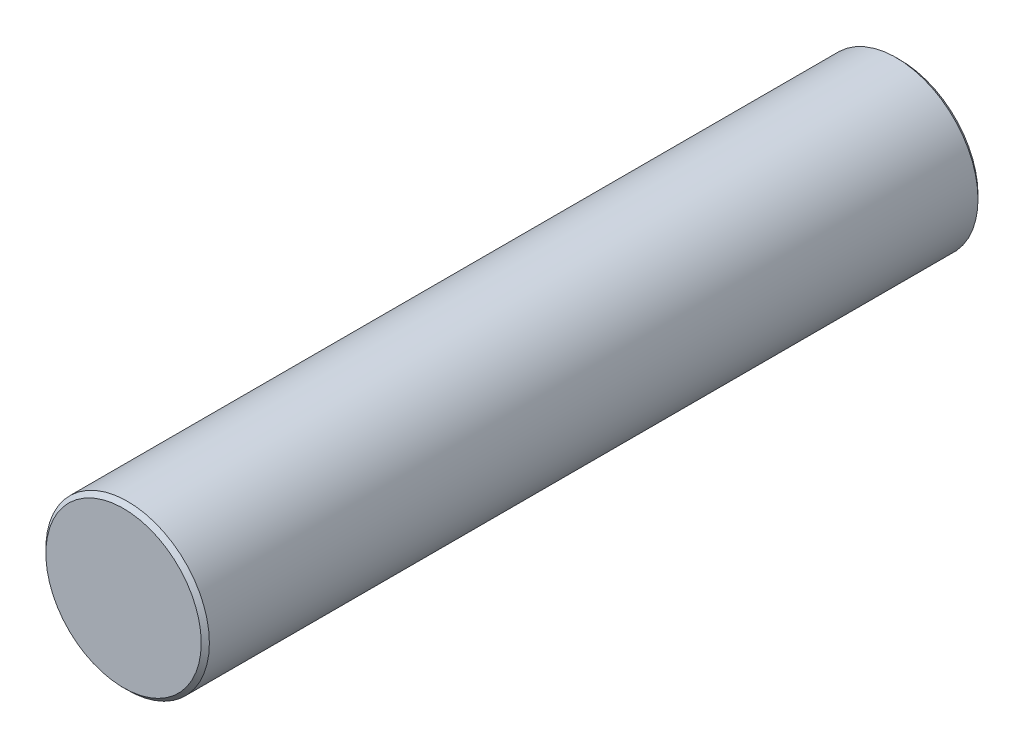
ISO-10303-21;
HEADER;
FILE_DESCRIPTION(('STEP AP214'),'2;1');
FILE_NAME('part.step','',(''),(''),'','','');
FILE_SCHEMA(('AUTOMOTIVE_DESIGN { 1 0 10303 214 1 1 1 1 }'));
ENDSEC;
DATA;
#1=APPLICATION_CONTEXT('core data for automotive mechanical design processes');
#2=APPLICATION_PROTOCOL_DEFINITION('international standard','automotive_design',2000,#1);
#3=PRODUCT_CONTEXT('',#1,'mechanical');
#4=PRODUCT('Part','Part','',(#3));
#5=PRODUCT_RELATED_PRODUCT_CATEGORY('part','',(#4));
#6=PRODUCT_DEFINITION_FORMATION('','',#4);
#7=PRODUCT_DEFINITION_CONTEXT('part definition',#1,'design');
#8=PRODUCT_DEFINITION('design','',#6,#7);
#9=PRODUCT_DEFINITION_SHAPE('','',#8);
#10=(LENGTH_UNIT() NAMED_UNIT(*) SI_UNIT(.MILLI.,.METRE.));
#11=(NAMED_UNIT(*) PLANE_ANGLE_UNIT() SI_UNIT($,.RADIAN.));
#12=(NAMED_UNIT(*) SI_UNIT($,.STERADIAN.) SOLID_ANGLE_UNIT());
#13=UNCERTAINTY_MEASURE_WITH_UNIT(LENGTH_MEASURE(1.E-05),#10,'distance_accuracy_value','');
#14=(GEOMETRIC_REPRESENTATION_CONTEXT(3) GLOBAL_UNCERTAINTY_ASSIGNED_CONTEXT((#13)) GLOBAL_UNIT_ASSIGNED_CONTEXT((#10,
#11,#12)) REPRESENTATION_CONTEXT('',''));
#15=CARTESIAN_POINT('',(0.,0.,0.));
#16=DIRECTION('',(0.,0.,1.));
#17=DIRECTION('',(1.,0.,0.));
#18=AXIS2_PLACEMENT_3D('',#15,#16,#17);
#19=CARTESIAN_POINT('',(0.,0.,190.));
#20=DIRECTION('',(0.,0.,-1.));
#21=DIRECTION('',(-1.,0.,0.));
#22=AXIS2_PLACEMENT_3D('',#19,#20,#21);
#23=CYLINDRICAL_SURFACE('',#22,20.);
#24=CARTESIAN_POINT('',(0.,0.,0.999999999999973));
#25=DIRECTION('',(0.,0.,1.));
#26=DIRECTION('',(1.,0.,0.));
#27=AXIS2_PLACEMENT_3D('',#24,#25,#26);
#28=CIRCLE('',#27,20.);
#29=CARTESIAN_POINT('',(20.,0.,0.999999999999973));
#30=VERTEX_POINT('',#29);
#31=EDGE_CURVE('E45',#30,#30,#28,.T.);
#32=ORIENTED_EDGE('',*,*,#31,.T.);
#33=EDGE_LOOP('',(#32));
#34=FACE_BOUND('',#33,.T.);
#35=CARTESIAN_POINT('',(0.,0.,189.));
#36=DIRECTION('',(0.,0.,1.));
#37=DIRECTION('',(1.,0.,0.));
#38=AXIS2_PLACEMENT_3D('',#35,#36,#37);
#39=CIRCLE('',#38,20.);
#40=CARTESIAN_POINT('',(20.,0.,189.));
#41=VERTEX_POINT('',#40);
#42=EDGE_CURVE('E49',#41,#41,#39,.F.);
#43=ORIENTED_EDGE('',*,*,#42,.T.);
#44=EDGE_LOOP('',(#43));
#45=FACE_BOUND('',#44,.T.);
#46=ADVANCED_FACE('F34',(#34,#45),#23,.T.);
#47=CARTESIAN_POINT('',(0.,0.,190.));
#48=DIRECTION('',(0.,0.,1.));
#49=DIRECTION('',(1.,0.,0.));
#50=AXIS2_PLACEMENT_3D('',#47,#48,#49);
#51=PLANE('',#50);
#52=CARTESIAN_POINT('',(0.,0.,190.));
#53=DIRECTION('',(0.,0.,1.));
#54=DIRECTION('',(1.,0.,0.));
#55=AXIS2_PLACEMENT_3D('',#52,#53,#54);
#56=CIRCLE('',#55,19.);
#57=CARTESIAN_POINT('',(19.,0.,190.));
#58=VERTEX_POINT('',#57);
#59=EDGE_CURVE('E10',#58,#58,#56,.T.);
#60=ORIENTED_EDGE('',*,*,#59,.T.);
#61=EDGE_LOOP('',(#60));
#62=FACE_BOUND('',#61,.T.);
#63=ADVANCED_FACE('F65',(#62),#51,.T.);
#64=CARTESIAN_POINT('',(0.,0.,0.));
#65=DIRECTION('',(0.,0.,1.));
#66=DIRECTION('',(1.,0.,0.));
#67=AXIS2_PLACEMENT_3D('',#64,#65,#66);
#68=PLANE('',#67);
#69=CARTESIAN_POINT('',(0.,0.,0.));
#70=DIRECTION('',(0.,0.,1.));
#71=DIRECTION('',(1.,0.,0.));
#72=AXIS2_PLACEMENT_3D('',#69,#70,#71);
#73=CIRCLE('',#72,19.);
#74=CARTESIAN_POINT('',(19.,0.,0.));
#75=VERTEX_POINT('',#74);
#76=EDGE_CURVE('E41',#75,#75,#73,.F.);
#77=ORIENTED_EDGE('',*,*,#76,.T.);
#78=EDGE_LOOP('',(#77));
#79=FACE_BOUND('',#78,.T.);
#80=ADVANCED_FACE('F62',(#79),#68,.F.);
#81=CARTESIAN_POINT('',(0.,0.,0.999999999999973));
#82=DIRECTION('',(0.,0.,1.));
#83=DIRECTION('',(1.,0.,0.));
#84=AXIS2_PLACEMENT_3D('',#81,#82,#83);
#85=CONICAL_SURFACE('',#84,20.,0.78539816339746);
#86=ORIENTED_EDGE('',*,*,#76,.F.);
#87=EDGE_LOOP('',(#86));
#88=FACE_BOUND('',#87,.T.);
#89=ORIENTED_EDGE('',*,*,#31,.F.);
#90=EDGE_LOOP('',(#89));
#91=FACE_BOUND('',#90,.T.);
#92=ADVANCED_FACE('F58',(#88,#91),#85,.T.);
#93=CARTESIAN_POINT('',(0.,0.,190.));
#94=DIRECTION('',(0.,0.,-1.));
#95=DIRECTION('',(-1.,0.,0.));
#96=AXIS2_PLACEMENT_3D('',#93,#94,#95);
#97=CONICAL_SURFACE('',#96,19.,0.785398163397454);
#98=ORIENTED_EDGE('',*,*,#42,.F.);
#99=EDGE_LOOP('',(#98));
#100=FACE_BOUND('',#99,.T.);
#101=ORIENTED_EDGE('',*,*,#59,.F.);
#102=EDGE_LOOP('',(#101));
#103=FACE_BOUND('',#102,.T.);
#104=ADVANCED_FACE('F36',(#100,#103),#97,.T.);
#105=CLOSED_SHELL('',(#46,#63,#80,#92,#104));
#106=MANIFOLD_SOLID_BREP('B2',#105);
#107=ADVANCED_BREP_SHAPE_REPRESENTATION('',(#18,#106),#14);
#108=SHAPE_DEFINITION_REPRESENTATION(#9,#107);
ENDSEC;
END-ISO-10303-21;
